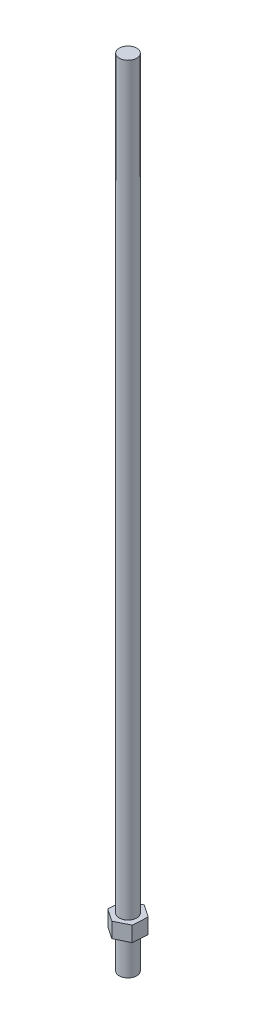
ISO-10303-21;
HEADER;
FILE_DESCRIPTION(('STEP AP214'),'2;1');
FILE_NAME('part.step','',(''),(''),'','','');
FILE_SCHEMA(('AUTOMOTIVE_DESIGN { 1 0 10303 214 1 1 1 1 }'));
ENDSEC;
DATA;
#1=APPLICATION_CONTEXT('core data for automotive mechanical design processes');
#2=APPLICATION_PROTOCOL_DEFINITION('international standard','automotive_design',2000,#1);
#3=PRODUCT_CONTEXT('',#1,'mechanical');
#4=PRODUCT('Part','Part','',(#3));
#5=PRODUCT_RELATED_PRODUCT_CATEGORY('part','',(#4));
#6=PRODUCT_DEFINITION_FORMATION('','',#4);
#7=PRODUCT_DEFINITION_CONTEXT('part definition',#1,'design');
#8=PRODUCT_DEFINITION('design','',#6,#7);
#9=PRODUCT_DEFINITION_SHAPE('','',#8);
#10=(LENGTH_UNIT() NAMED_UNIT(*) SI_UNIT(.MILLI.,.METRE.));
#11=(NAMED_UNIT(*) PLANE_ANGLE_UNIT() SI_UNIT($,.RADIAN.));
#12=(NAMED_UNIT(*) SI_UNIT($,.STERADIAN.) SOLID_ANGLE_UNIT());
#13=UNCERTAINTY_MEASURE_WITH_UNIT(LENGTH_MEASURE(1.E-05),#10,'distance_accuracy_value','');
#14=(GEOMETRIC_REPRESENTATION_CONTEXT(3) GLOBAL_UNCERTAINTY_ASSIGNED_CONTEXT((#13)) GLOBAL_UNIT_ASSIGNED_CONTEXT((#10,
#11,#12)) REPRESENTATION_CONTEXT('',''));
#15=CARTESIAN_POINT('',(0.,0.,0.));
#16=DIRECTION('',(0.,0.,1.));
#17=DIRECTION('',(1.,0.,0.));
#18=AXIS2_PLACEMENT_3D('',#15,#16,#17);
#19=CARTESIAN_POINT('',(0.,577.85,0.));
#20=DIRECTION('',(0.,-1.,0.));
#21=DIRECTION('',(0.,0.,-1.));
#22=AXIS2_PLACEMENT_3D('',#19,#20,#21);
#23=CYLINDRICAL_SURFACE('',#22,6.35);
#24=CARTESIAN_POINT('',(0.,36.449,0.));
#25=DIRECTION('',(0.,1.,0.));
#26=DIRECTION('',(0.,0.,1.));
#27=AXIS2_PLACEMENT_3D('',#24,#25,#26);
#28=CIRCLE('',#27,6.35);
#29=CARTESIAN_POINT('',(0.,36.449,6.35));
#30=VERTEX_POINT('',#29);
#31=EDGE_CURVE('E35',#30,#30,#28,.T.);
#32=ORIENTED_EDGE('',*,*,#31,.T.);
#33=EDGE_LOOP('',(#32));
#34=FACE_BOUND('',#33,.T.);
#35=CARTESIAN_POINT('',(0.,577.85,0.));
#36=DIRECTION('',(0.,1.,0.));
#37=DIRECTION('',(0.,0.,1.));
#38=AXIS2_PLACEMENT_3D('',#35,#36,#37);
#39=CIRCLE('',#38,6.35);
#40=CARTESIAN_POINT('',(0.,577.85,6.35));
#41=VERTEX_POINT('',#40);
#42=EDGE_CURVE('E41',#41,#41,#39,.T.);
#43=ORIENTED_EDGE('',*,*,#42,.F.);
#44=EDGE_LOOP('',(#43));
#45=FACE_BOUND('',#44,.T.);
#46=ADVANCED_FACE('F32',(#34,#45),#23,.T.);
#47=CARTESIAN_POINT('',(0.,577.85,0.));
#48=DIRECTION('',(0.,1.,0.));
#49=DIRECTION('',(0.,0.,1.));
#50=AXIS2_PLACEMENT_3D('',#47,#48,#49);
#51=PLANE('',#50);
#52=ORIENTED_EDGE('',*,*,#42,.T.);
#53=EDGE_LOOP('',(#52));
#54=FACE_BOUND('',#53,.T.);
#55=ADVANCED_FACE('F150',(#54),#51,.T.);
#56=CARTESIAN_POINT('',(0.,36.449,0.));
#57=DIRECTION('',(0.,1.,0.));
#58=DIRECTION('',(0.,0.,1.));
#59=AXIS2_PLACEMENT_3D('',#56,#57,#58);
#60=PLANE('',#59);
#61=DIRECTION('',(0.0679923661634542,0.,-0.99768584140675));
#62=VECTOR('',#61,1.);
#63=CARTESIAN_POINT('',(9.12904985050717,36.449,6.1341624389117));
#64=LINE('',#63,#62);
#65=CARTESIAN_POINT('',(9.12904985050717,36.449,6.1341624389117));
#66=VERTEX_POINT('',#65);
#67=CARTESIAN_POINT('',(9.87686542829142,36.449,-4.83890786349789));
#68=VERTEX_POINT('',#67);
#69=EDGE_CURVE('E129',#66,#68,#64,.T.);
#70=ORIENTED_EDGE('',*,*,#69,.T.);
#71=DIRECTION('',(-0.830025100572571,0.,-0.55772603706434));
#72=VECTOR('',#71,1.);
#73=CARTESIAN_POINT('',(9.87686542829142,36.449,-4.83890786349789));
#74=LINE('',#73,#72);
#75=CARTESIAN_POINT('',(0.747815577784257,36.449,-10.9730703024096));
#76=VERTEX_POINT('',#75);
#77=EDGE_CURVE('E87',#68,#76,#74,.T.);
#78=ORIENTED_EDGE('',*,*,#77,.T.);
#79=DIRECTION('',(-0.898017466736025,0.,0.43995980434241));
#80=VECTOR('',#79,1.);
#81=CARTESIAN_POINT('',(0.747815577784257,36.449,-10.9730703024096));
#82=LINE('',#81,#80);
#83=CARTESIAN_POINT('',(-9.12904985050717,36.449,-6.1341624389117));
#84=VERTEX_POINT('',#83);
#85=EDGE_CURVE('E101',#76,#84,#82,.T.);
#86=ORIENTED_EDGE('',*,*,#85,.T.);
#87=DIRECTION('',(-0.0679923661634545,0.,0.99768584140675));
#88=VECTOR('',#87,1.);
#89=CARTESIAN_POINT('',(-9.12904985050717,36.449,-6.1341624389117));
#90=LINE('',#89,#88);
#91=CARTESIAN_POINT('',(-9.87686542829143,36.449,4.83890786349789));
#92=VERTEX_POINT('',#91);
#93=EDGE_CURVE('E94',#84,#92,#90,.T.);
#94=ORIENTED_EDGE('',*,*,#93,.T.);
#95=DIRECTION('',(0.830025100572571,0.,0.55772603706434));
#96=VECTOR('',#95,1.);
#97=CARTESIAN_POINT('',(-9.87686542829143,36.449,4.83890786349789));
#98=LINE('',#97,#96);
#99=CARTESIAN_POINT('',(-0.747815577784261,36.449,10.9730703024096));
#100=VERTEX_POINT('',#99);
#101=EDGE_CURVE('E99',#92,#100,#98,.T.);
#102=ORIENTED_EDGE('',*,*,#101,.T.);
#103=DIRECTION('',(0.898017466736025,0.,-0.43995980434241));
#104=VECTOR('',#103,1.);
#105=CARTESIAN_POINT('',(-0.747815577784261,36.449,10.9730703024096));
#106=LINE('',#105,#104);
#107=EDGE_CURVE('E49',#100,#66,#106,.T.);
#108=ORIENTED_EDGE('',*,*,#107,.T.);
#109=EDGE_LOOP('',(#70,#78,#86,#94,#102,#108));
#110=FACE_BOUND('',#109,.T.);
#111=ORIENTED_EDGE('',*,*,#31,.F.);
#112=EDGE_LOOP('',(#111));
#113=FACE_BOUND('',#112,.T.);
#114=ADVANCED_FACE('F96',(#110,#113),#60,.T.);
#115=CARTESIAN_POINT('',(0.,25.4,0.));
#116=DIRECTION('',(0.,1.,0.));
#117=DIRECTION('',(0.,0.,1.));
#118=AXIS2_PLACEMENT_3D('',#115,#116,#117);
#119=PLANE('',#118);
#120=DIRECTION('',(0.0679923661634542,0.,-0.99768584140675));
#121=VECTOR('',#120,1.);
#122=CARTESIAN_POINT('',(9.12904985050717,25.4,6.1341624389117));
#123=LINE('',#122,#121);
#124=CARTESIAN_POINT('',(9.12904985050717,25.4,6.1341624389117));
#125=VERTEX_POINT('',#124);
#126=CARTESIAN_POINT('',(9.87686542829142,25.4,-4.83890786349789));
#127=VERTEX_POINT('',#126);
#128=EDGE_CURVE('E119',#125,#127,#123,.T.);
#129=ORIENTED_EDGE('',*,*,#128,.F.);
#130=DIRECTION('',(0.898017466736025,0.,-0.43995980434241));
#131=VECTOR('',#130,1.);
#132=CARTESIAN_POINT('',(-0.747815577784261,25.4,10.9730703024096));
#133=LINE('',#132,#131);
#134=CARTESIAN_POINT('',(-0.747815577784261,25.4,10.9730703024096));
#135=VERTEX_POINT('',#134);
#136=EDGE_CURVE('E78',#135,#125,#133,.T.);
#137=ORIENTED_EDGE('',*,*,#136,.F.);
#138=DIRECTION('',(0.830025100572571,0.,0.55772603706434));
#139=VECTOR('',#138,1.);
#140=CARTESIAN_POINT('',(-9.87686542829143,25.4,4.83890786349789));
#141=LINE('',#140,#139);
#142=CARTESIAN_POINT('',(-9.87686542829143,25.4,4.83890786349789));
#143=VERTEX_POINT('',#142);
#144=EDGE_CURVE('E72',#143,#135,#141,.T.);
#145=ORIENTED_EDGE('',*,*,#144,.F.);
#146=DIRECTION('',(-0.0679923661634545,0.,0.99768584140675));
#147=VECTOR('',#146,1.);
#148=CARTESIAN_POINT('',(-9.12904985050717,25.4,-6.1341624389117));
#149=LINE('',#148,#147);
#150=CARTESIAN_POINT('',(-9.12904985050717,25.4,-6.1341624389117));
#151=VERTEX_POINT('',#150);
#152=EDGE_CURVE('E109',#151,#143,#149,.T.);
#153=ORIENTED_EDGE('',*,*,#152,.F.);
#154=DIRECTION('',(-0.898017466736025,0.,0.43995980434241));
#155=VECTOR('',#154,1.);
#156=CARTESIAN_POINT('',(0.747815577784257,25.4,-10.9730703024096));
#157=LINE('',#156,#155);
#158=CARTESIAN_POINT('',(0.747815577784257,25.4,-10.9730703024096));
#159=VERTEX_POINT('',#158);
#160=EDGE_CURVE('E124',#159,#151,#157,.T.);
#161=ORIENTED_EDGE('',*,*,#160,.F.);
#162=DIRECTION('',(-0.830025100572571,0.,-0.55772603706434));
#163=VECTOR('',#162,1.);
#164=CARTESIAN_POINT('',(9.87686542829142,25.4,-4.83890786349789));
#165=LINE('',#164,#163);
#166=EDGE_CURVE('E122',#127,#159,#165,.T.);
#167=ORIENTED_EDGE('',*,*,#166,.F.);
#168=EDGE_LOOP('',(#129,#137,#145,#153,#161,#167));
#169=FACE_BOUND('',#168,.T.);
#170=CARTESIAN_POINT('',(0.,25.4,0.));
#171=DIRECTION('',(0.,1.,0.));
#172=DIRECTION('',(0.,0.,1.));
#173=AXIS2_PLACEMENT_3D('',#170,#171,#172);
#174=CIRCLE('',#173,6.35);
#175=CARTESIAN_POINT('',(0.,25.4,6.35));
#176=VERTEX_POINT('',#175);
#177=EDGE_CURVE('E11',#176,#176,#174,.T.);
#178=ORIENTED_EDGE('',*,*,#177,.T.);
#179=EDGE_LOOP('',(#178));
#180=FACE_BOUND('',#179,.T.);
#181=ADVANCED_FACE('F149',(#169,#180),#119,.F.);
#182=CARTESIAN_POINT('',(9.12904985050717,36.449,6.1341624389117));
#183=DIRECTION('',(-0.99768584140675,0.,-0.0679923661634542));
#184=DIRECTION('',(-0.0679923661634542,0.,0.99768584140675));
#185=AXIS2_PLACEMENT_3D('',#182,#183,#184);
#186=PLANE('',#185);
#187=ORIENTED_EDGE('',*,*,#128,.T.);
#188=DIRECTION('',(0.,-1.,0.));
#189=VECTOR('',#188,1.);
#190=CARTESIAN_POINT('',(9.87686542829142,36.449,-4.83890786349789));
#191=LINE('',#190,#189);
#192=EDGE_CURVE('E136',#68,#127,#191,.T.);
#193=ORIENTED_EDGE('',*,*,#192,.F.);
#194=ORIENTED_EDGE('',*,*,#69,.F.);
#195=DIRECTION('',(0.,-1.,0.));
#196=VECTOR('',#195,1.);
#197=CARTESIAN_POINT('',(9.12904985050717,36.449,6.1341624389117));
#198=LINE('',#197,#196);
#199=EDGE_CURVE('E115',#66,#125,#198,.T.);
#200=ORIENTED_EDGE('',*,*,#199,.T.);
#201=EDGE_LOOP('',(#187,#193,#194,#200));
#202=FACE_BOUND('',#201,.T.);
#203=ADVANCED_FACE('F156',(#202),#186,.F.);
#204=CARTESIAN_POINT('',(9.87686542829142,36.449,-4.83890786349789));
#205=DIRECTION('',(-0.55772603706434,0.,0.830025100572571));
#206=DIRECTION('',(0.830025100572571,0.,0.55772603706434));
#207=AXIS2_PLACEMENT_3D('',#204,#205,#206);
#208=PLANE('',#207);
#209=ORIENTED_EDGE('',*,*,#166,.T.);
#210=DIRECTION('',(0.,-1.,0.));
#211=VECTOR('',#210,1.);
#212=CARTESIAN_POINT('',(0.747815577784257,36.449,-10.9730703024096));
#213=LINE('',#212,#211);
#214=EDGE_CURVE('E133',#76,#159,#213,.T.);
#215=ORIENTED_EDGE('',*,*,#214,.F.);
#216=ORIENTED_EDGE('',*,*,#77,.F.);
#217=ORIENTED_EDGE('',*,*,#192,.T.);
#218=EDGE_LOOP('',(#209,#215,#216,#217));
#219=FACE_BOUND('',#218,.T.);
#220=ADVANCED_FACE('F182',(#219),#208,.F.);
#221=CARTESIAN_POINT('',(0.747815577784257,36.449,-10.9730703024096));
#222=DIRECTION('',(0.43995980434241,0.,0.898017466736025));
#223=DIRECTION('',(0.898017466736025,0.,-0.43995980434241));
#224=AXIS2_PLACEMENT_3D('',#221,#222,#223);
#225=PLANE('',#224);
#226=ORIENTED_EDGE('',*,*,#160,.T.);
#227=DIRECTION('',(0.,-1.,0.));
#228=VECTOR('',#227,1.);
#229=CARTESIAN_POINT('',(-9.12904985050717,36.449,-6.1341624389117));
#230=LINE('',#229,#228);
#231=EDGE_CURVE('E110',#84,#151,#230,.T.);
#232=ORIENTED_EDGE('',*,*,#231,.F.);
#233=ORIENTED_EDGE('',*,*,#85,.F.);
#234=ORIENTED_EDGE('',*,*,#214,.T.);
#235=EDGE_LOOP('',(#226,#232,#233,#234));
#236=FACE_BOUND('',#235,.T.);
#237=ADVANCED_FACE('F186',(#236),#225,.F.);
#238=CARTESIAN_POINT('',(-9.12904985050717,36.449,-6.1341624389117));
#239=DIRECTION('',(0.99768584140675,0.,0.0679923661634545));
#240=DIRECTION('',(0.0679923661634545,0.,-0.99768584140675));
#241=AXIS2_PLACEMENT_3D('',#238,#239,#240);
#242=PLANE('',#241);
#243=ORIENTED_EDGE('',*,*,#152,.T.);
#244=DIRECTION('',(0.,-1.,0.));
#245=VECTOR('',#244,1.);
#246=CARTESIAN_POINT('',(-9.87686542829143,36.449,4.83890786349789));
#247=LINE('',#246,#245);
#248=EDGE_CURVE('E106',#92,#143,#247,.T.);
#249=ORIENTED_EDGE('',*,*,#248,.F.);
#250=ORIENTED_EDGE('',*,*,#93,.F.);
#251=ORIENTED_EDGE('',*,*,#231,.T.);
#252=EDGE_LOOP('',(#243,#249,#250,#251));
#253=FACE_BOUND('',#252,.T.);
#254=ADVANCED_FACE('F107',(#253),#242,.F.);
#255=CARTESIAN_POINT('',(-9.87686542829143,36.449,4.83890786349789));
#256=DIRECTION('',(0.55772603706434,0.,-0.830025100572571));
#257=DIRECTION('',(-0.830025100572571,0.,-0.55772603706434));
#258=AXIS2_PLACEMENT_3D('',#255,#256,#257);
#259=PLANE('',#258);
#260=ORIENTED_EDGE('',*,*,#144,.T.);
#261=DIRECTION('',(0.,-1.,0.));
#262=VECTOR('',#261,1.);
#263=CARTESIAN_POINT('',(-0.747815577784261,36.449,10.9730703024096));
#264=LINE('',#263,#262);
#265=EDGE_CURVE('E111',#100,#135,#264,.T.);
#266=ORIENTED_EDGE('',*,*,#265,.F.);
#267=ORIENTED_EDGE('',*,*,#101,.F.);
#268=ORIENTED_EDGE('',*,*,#248,.T.);
#269=EDGE_LOOP('',(#260,#266,#267,#268));
#270=FACE_BOUND('',#269,.T.);
#271=ADVANCED_FACE('F113',(#270),#259,.F.);
#272=CARTESIAN_POINT('',(-0.747815577784261,36.449,10.9730703024096));
#273=DIRECTION('',(-0.43995980434241,0.,-0.898017466736025));
#274=DIRECTION('',(-0.898017466736026,0.,0.43995980434241));
#275=AXIS2_PLACEMENT_3D('',#272,#273,#274);
#276=PLANE('',#275);
#277=ORIENTED_EDGE('',*,*,#136,.T.);
#278=ORIENTED_EDGE('',*,*,#199,.F.);
#279=ORIENTED_EDGE('',*,*,#107,.F.);
#280=ORIENTED_EDGE('',*,*,#265,.T.);
#281=EDGE_LOOP('',(#277,#278,#279,#280));
#282=FACE_BOUND('',#281,.T.);
#283=ADVANCED_FACE('F170',(#282),#276,.F.);
#284=CARTESIAN_POINT('',(0.,0.,0.));
#285=DIRECTION('',(0.,1.,0.));
#286=DIRECTION('',(0.,0.,1.));
#287=AXIS2_PLACEMENT_3D('',#284,#285,#286);
#288=PLANE('',#287);
#289=CARTESIAN_POINT('',(0.,0.,0.));
#290=DIRECTION('',(0.,1.,0.));
#291=DIRECTION('',(0.,0.,1.));
#292=AXIS2_PLACEMENT_3D('',#289,#290,#291);
#293=CIRCLE('',#292,6.35);
#294=CARTESIAN_POINT('',(0.,0.,6.35));
#295=VERTEX_POINT('',#294);
#296=EDGE_CURVE('E140',#295,#295,#293,.T.);
#297=ORIENTED_EDGE('',*,*,#296,.F.);
#298=EDGE_LOOP('',(#297));
#299=FACE_BOUND('',#298,.T.);
#300=ADVANCED_FACE('F166',(#299),#288,.F.);
#301=ORIENTED_EDGE('',*,*,#296,.T.);
#302=EDGE_LOOP('',(#301));
#303=FACE_BOUND('',#302,.T.);
#304=ORIENTED_EDGE('',*,*,#177,.F.);
#305=EDGE_LOOP('',(#304));
#306=FACE_BOUND('',#305,.T.);
#307=ADVANCED_FACE('F162',(#303,#306),#23,.T.);
#308=CLOSED_SHELL('',(#46,#55,#114,#181,#203,#220,#237,#254,#271,#283,#300,#307));
#309=MANIFOLD_SOLID_BREP('B2',#308);
#310=ADVANCED_BREP_SHAPE_REPRESENTATION('',(#18,#309),#14);
#311=SHAPE_DEFINITION_REPRESENTATION(#9,#310);
ENDSEC;
END-ISO-10303-21;
